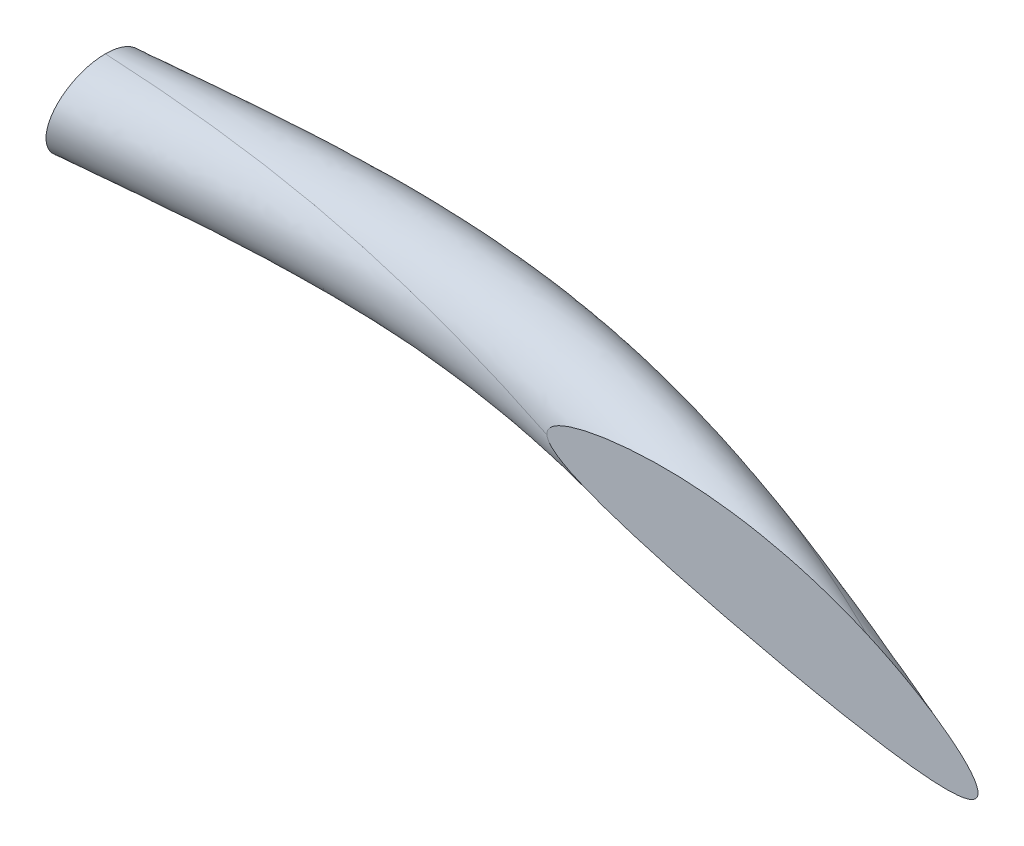
ISO-10303-21;
HEADER;
FILE_DESCRIPTION(('STEP AP214'),'2;1');
FILE_NAME('part.step','',(''),(''),'','','');
FILE_SCHEMA(('AUTOMOTIVE_DESIGN { 1 0 10303 214 1 1 1 1 }'));
ENDSEC;
DATA;
#1=APPLICATION_CONTEXT('core data for automotive mechanical design processes');
#2=APPLICATION_PROTOCOL_DEFINITION('international standard','automotive_design',2000,#1);
#3=PRODUCT_CONTEXT('',#1,'mechanical');
#4=PRODUCT('Part','Part','',(#3));
#5=PRODUCT_RELATED_PRODUCT_CATEGORY('part','',(#4));
#6=PRODUCT_DEFINITION_FORMATION('','',#4);
#7=PRODUCT_DEFINITION_CONTEXT('part definition',#1,'design');
#8=PRODUCT_DEFINITION('design','',#6,#7);
#9=PRODUCT_DEFINITION_SHAPE('','',#8);
#10=(LENGTH_UNIT() NAMED_UNIT(*) SI_UNIT(.MILLI.,.METRE.));
#11=(NAMED_UNIT(*) PLANE_ANGLE_UNIT() SI_UNIT($,.RADIAN.));
#12=(NAMED_UNIT(*) SI_UNIT($,.STERADIAN.) SOLID_ANGLE_UNIT());
#13=UNCERTAINTY_MEASURE_WITH_UNIT(LENGTH_MEASURE(1.E-05),#10,'distance_accuracy_value','');
#14=(GEOMETRIC_REPRESENTATION_CONTEXT(3) GLOBAL_UNCERTAINTY_ASSIGNED_CONTEXT((#13)) GLOBAL_UNIT_ASSIGNED_CONTEXT((#10,
#11,#12)) REPRESENTATION_CONTEXT('',''));
#15=CARTESIAN_POINT('',(0.,0.,0.));
#16=DIRECTION('',(0.,0.,1.));
#17=DIRECTION('',(1.,0.,0.));
#18=AXIS2_PLACEMENT_3D('',#15,#16,#17);
#19=CARTESIAN_POINT('',(0.,0.,0.));
#20=DIRECTION('',(0.,0.,1.));
#21=DIRECTION('',(1.,0.,0.));
#22=AXIS2_PLACEMENT_3D('',#19,#20,#21);
#23=PLANE('',#22);
#24=CARTESIAN_POINT('',(15.1545876871134,-4.28927799328883,0.));
#25=CARTESIAN_POINT('',(15.1181243170063,-4.27334871738877,0.));
#26=CARTESIAN_POINT('',(15.0812952441633,-4.2582644201544,0.));
#27=CARTESIAN_POINT('',(15.0069946485799,-4.22976043701186,0.));
#28=CARTESIAN_POINT('',(14.9695230746855,-4.21634088435277,0.));
#29=CARTESIAN_POINT('',(14.8939301368644,-4.19110948653116,0.));
#30=CARTESIAN_POINT('',(14.8558072887579,-4.17930209095788,0.));
#31=CARTESIAN_POINT('',(14.7790849554384,-4.15736616791501,0.));
#32=CARTESIAN_POINT('',(14.7404854964331,-4.14723754857129,0.));
#33=CARTESIAN_POINT('',(14.6290167928493,-4.12067047478006,0.));
#34=CARTESIAN_POINT('',(14.5556136687536,-4.10643112773538,0.));
#35=CARTESIAN_POINT('',(14.4080680671878,-4.08397624388415,0.));
#36=CARTESIAN_POINT('',(14.3339277174698,-4.07574671277815,0.));
#37=CARTESIAN_POINT('',(14.2225457996808,-4.0681470931353,0.));
#38=CARTESIAN_POINT('',(14.1854579790964,-4.06640354650086,0.));
#39=CARTESIAN_POINT('',(14.1297285732536,-4.06504649584388,0.));
#40=CARTESIAN_POINT('',(14.1111021107461,-4.06480456445942,0.));
#41=CARTESIAN_POINT('',(14.0738490300188,-4.06477678993557,0.));
#42=CARTESIAN_POINT('',(14.0552224118017,-4.06499095445912,0.));
#43=CARTESIAN_POINT('',(13.9989973955555,-4.06625167518482,0.));
#44=CARTESIAN_POINT('',(13.9614103507879,-4.06792410934439,0.));
#45=CARTESIAN_POINT('',(13.8863083473254,-4.07311330575888,0.));
#46=CARTESIAN_POINT('',(13.8487935761266,-4.07663277866245,0.));
#47=CARTESIAN_POINT('',(13.774271402616,-4.08587748446365,0.));
#48=CARTESIAN_POINT('',(13.7372622848487,-4.0915875841855,0.));
#49=CARTESIAN_POINT('',(13.6822662770898,-4.10253927336216,0.));
#50=CARTESIAN_POINT('',(13.6640409402991,-4.10658165831164,0.));
#51=CARTESIAN_POINT('',(13.6278619404032,-4.11572737106718,0.));
#52=CARTESIAN_POINT('',(13.6099080457382,-4.12082973262418,0.));
#53=CARTESIAN_POINT('',(13.5844856851215,-4.12930135993528,0.));
#54=CARTESIAN_POINT('',(13.5768042151664,-4.13202928906399,0.));
#55=CARTESIAN_POINT('',(13.5615722305509,-4.13787967926091,0.));
#56=CARTESIAN_POINT('',(13.5540220193831,-4.14100294414533,0.));
#57=CARTESIAN_POINT('',(13.5385195155854,-4.14804405188475,0.));
#58=CARTESIAN_POINT('',(13.5305873432079,-4.15200679213643,1.8377238870652E-13));
#59=CARTESIAN_POINT('',(13.5152176653499,-4.16078384722854,-1.83097207067371E-13));
#60=CARTESIAN_POINT('',(13.5077784495294,-4.16559497988475,-6.8736402754007E-13));
#61=CARTESIAN_POINT('',(13.4952171227837,-4.17549258963199,-5.74875282358534E-13));
#62=CARTESIAN_POINT('',(13.489922983129,-4.18035446096102,-1.5229396050939E-13));
#63=CARTESIAN_POINT('',(13.4806836918408,-4.19148170566382,1.53606247488127E-13));
#64=CARTESIAN_POINT('',(13.4767522851241,-4.19776038117712,0.));
#65=CARTESIAN_POINT('',(13.4729047779431,-4.20928244697291,0.));
#66=CARTESIAN_POINT('',(13.4720985446064,-4.21419825666302,0.));
#67=CARTESIAN_POINT('',(13.4721627753132,-4.22038044714986,0.));
#68=CARTESIAN_POINT('',(13.4722370143611,-4.22167786624889,0.));
#69=CARTESIAN_POINT('',(13.472374121944,-4.22296712247633,0.));
#70=B_SPLINE_CURVE_WITH_KNOTS('',3,(#24,#25,#26,#27,#28,#29,#30,#31,#32,#33,#34,#35,#36,#37,#38,
#39,#40,#41,#42,#43,#44,#45,#46,#47,#48,#49,#50,#51,#52,#53,#54,#55,#56,#57,#58,#59,#60,#61,#62,
#63,#64,#65,#66,#67,#68,#69),.UNSPECIFIED.,.F.,.F.,(4,2,2,2,2,2,2,2,2,2,2,2,2,2,2,2,2,2,2,2,2,2,
4),(0.,0.119357406752123,0.23872436092545,0.358414383804627,0.478097854261914,0.702141553349013,
0.9256618720119,1.03701507155676,1.09289379201093,1.14877345129999,1.26160167142086,
1.37459593919679,1.48682328660203,1.54281004897532,1.59874599737229,1.62319308642761,
1.64769070593966,1.67426357152597,1.70073880813184,1.72220129041977,1.74387434709188,
1.75849752181143,1.76239048272044),.UNSPECIFIED.);
#71=CARTESIAN_POINT('',(15.1545876871134,-4.28927799328883,0.));
#72=VERTEX_POINT('',#71);
#73=CARTESIAN_POINT('',(13.472374121944,-4.22296712247633,0.));
#74=VERTEX_POINT('',#73);
#75=EDGE_CURVE('E11',#72,#74,#70,.T.);
#76=ORIENTED_EDGE('',*,*,#75,.T.);
#77=CARTESIAN_POINT('',(13.472374121944,-4.22296712247633,0.));
#78=CARTESIAN_POINT('',(13.4726941596036,-4.22616155823125,0.));
#79=CARTESIAN_POINT('',(13.4733711508282,-4.22929105450249,0.));
#80=CARTESIAN_POINT('',(13.4752633786644,-4.23532722567702,0.));
#81=CARTESIAN_POINT('',(13.4764690009374,-4.23823683906789,0.));
#82=CARTESIAN_POINT('',(13.4820843471676,-4.24951875821943,0.));
#83=CARTESIAN_POINT('',(13.488052791459,-4.25707544547777,0.));
#84=CARTESIAN_POINT('',(13.4994505486749,-4.26896686353019,0.));
#85=CARTESIAN_POINT('',(13.5046033242716,-4.27362466285265,0.));
#86=CARTESIAN_POINT('',(13.5153250050976,-4.2824431787203,0.));
#87=CARTESIAN_POINT('',(13.5208934769822,-4.28660440147925,0.));
#88=CARTESIAN_POINT('',(13.5323043086526,-4.2945729351573,0.));
#89=CARTESIAN_POINT('',(13.5381477654923,-4.29837860873243,0.));
#90=CARTESIAN_POINT('',(13.5500082359285,-4.30570663045111,0.));
#91=CARTESIAN_POINT('',(13.5560252212572,-4.30922902439057,0.));
#92=CARTESIAN_POINT('',(13.5757383662182,-4.32029920319647,0.));
#93=CARTESIAN_POINT('',(13.5896802688035,-4.32740637105405,0.));
#94=CARTESIAN_POINT('',(13.6179005824677,-4.34092351399825,0.));
#95=CARTESIAN_POINT('',(13.6321792302612,-4.34733297971847,0.));
#96=CARTESIAN_POINT('',(13.6753768843799,-4.36585738227822,0.));
#97=CARTESIAN_POINT('',(13.7046070609665,-4.37724250304956,0.));
#98=CARTESIAN_POINT('',(13.7634836980823,-4.39891472186486,0.));
#99=CARTESIAN_POINT('',(13.7931304717652,-4.40920093772631,0.));
#100=CARTESIAN_POINT('',(13.8526329526563,-4.42901207597649,0.));
#101=CARTESIAN_POINT('',(13.8824883288,-4.43853799457885,0.));
#102=CARTESIAN_POINT('',(14.0034333308587,-4.47594856011203,0.));
#103=CARTESIAN_POINT('',(14.0951946732326,-4.50164194330327,0.));
#104=CARTESIAN_POINT('',(14.2794414891853,-4.55051487608991,0.));
#105=CARTESIAN_POINT('',(14.3719275091064,-4.57369228327952,2.88401553179689E-13));
#106=CARTESIAN_POINT('',(14.5571770497467,-4.61803853577824,-2.87799201953779E-13));
#107=CARTESIAN_POINT('',(14.6499395874404,-4.63921147503583,-1.07384588502129E-12));
#108=CARTESIAN_POINT('',(14.8358668385133,-4.67955840034171,1.07343169654796E-12));
#109=CARTESIAN_POINT('',(14.9290313829708,-4.69873315424777,4.00532149556793E-12));
#110=CARTESIAN_POINT('',(15.053997156159,-4.72240090281989,1.57538962189725E-12));
#111=CARTESIAN_POINT('',(15.0855501064252,-4.7282027476536,4.22106148181216E-13));
#112=CARTESIAN_POINT('',(15.1487400042799,-4.73935119409682,-4.22146146660728E-13));
#113=CARTESIAN_POINT('',(15.1803769595446,-4.74469775251571,-1.12976389530602E-13));
#114=CARTESIAN_POINT('',(15.2437546542119,-4.75485041834334,1.13034546920223E-13));
#115=CARTESIAN_POINT('',(15.2754954386563,-4.75965624612476,0.));
#116=CARTESIAN_POINT('',(15.3390783877935,-4.76853166566273,0.));
#117=CARTESIAN_POINT('',(15.3709205391121,-4.77260135075551,0.));
#118=CARTESIAN_POINT('',(15.4309217419722,-4.77920504210929,0.));
#119=CARTESIAN_POINT('',(15.4590666145692,-4.78186438778478,0.));
#120=CARTESIAN_POINT('',(15.5154267965558,-4.78581651651648,0.));
#121=CARTESIAN_POINT('',(15.543641956386,-4.78711116894369,0.));
#122=CARTESIAN_POINT('',(15.5908065177725,-4.7871163406721,0.));
#123=CARTESIAN_POINT('',(15.6097434933178,-4.78653817275815,0.));
#124=CARTESIAN_POINT('',(15.6378243266682,-4.78402474439515,0.));
#125=CARTESIAN_POINT('',(15.6470363715417,-4.78293214525303,0.));
#126=CARTESIAN_POINT('',(15.6653210802561,-4.77993674266482,0.));
#127=CARTESIAN_POINT('',(15.6743939346872,-4.77803517335985,0.));
#128=CARTESIAN_POINT('',(15.6922380643563,-4.77292630989152,0.));
#129=CARTESIAN_POINT('',(15.7010084863035,-4.76971560453962,0.));
#130=CARTESIAN_POINT('',(15.71539446508,-4.76193704343175,0.));
#131=CARTESIAN_POINT('',(15.7212567933303,-4.75789370819147,0.));
#132=CARTESIAN_POINT('',(15.7296805325067,-4.74918003772342,0.));
#133=CARTESIAN_POINT('',(15.7327064941739,-4.74499401818962,0.));
#134=CARTESIAN_POINT('',(15.737052105904,-4.73578403274836,0.));
#135=CARTESIAN_POINT('',(15.7383660723539,-4.73075733789521,1.4913528519066E-13));
#136=CARTESIAN_POINT('',(15.7394557475371,-4.71935122611031,1.77637775891137E-13));
#137=CARTESIAN_POINT('',(15.7387754324158,-4.71294226211483,0.));
#138=CARTESIAN_POINT('',(15.7361061167175,-4.7013720115497,0.));
#139=CARTESIAN_POINT('',(15.7343000795966,-4.69615722022901,0.));
#140=CARTESIAN_POINT('',(15.729987631816,-4.68601377229952,0.));
#141=CARTESIAN_POINT('',(15.7274790789012,-4.68108604748842,0.));
#142=CARTESIAN_POINT('',(15.7205306223097,-4.66889526330596,0.));
#143=CARTESIAN_POINT('',(15.7157807929718,-4.66181382673097,0.));
#144=CARTESIAN_POINT('',(15.7056683796355,-4.64812556032854,0.));
#145=CARTESIAN_POINT('',(15.7003060790298,-4.64151851328574,0.));
#146=CARTESIAN_POINT('',(15.6835565181969,-4.62215384058449,0.));
#147=CARTESIAN_POINT('',(15.6715577942469,-4.60992946117802,0.));
#148=CARTESIAN_POINT('',(15.6469019421103,-4.58659010875435,0.));
#149=CARTESIAN_POINT('',(15.6342575748672,-4.57546111077839,0.));
#150=CARTESIAN_POINT('',(15.6084038743425,-4.55386857953258,0.));
#151=CARTESIAN_POINT('',(15.5951942619734,-4.54340538149015,0.));
#152=CARTESIAN_POINT('',(15.5550541402107,-4.51287393264059,0.));
#153=CARTESIAN_POINT('',(15.5275295729459,-4.49358997307651,0.));
#154=CARTESIAN_POINT('',(15.472186778073,-4.45704573882289,0.));
#155=CARTESIAN_POINT('',(15.444393856247,-4.43974644891943,0.));
#156=CARTESIAN_POINT('',(15.3880550760593,-4.40639658914301,0.));
#157=CARTESIAN_POINT('',(15.3595089103912,-4.39034653981809,0.));
#158=CARTESIAN_POINT('',(15.3018915857084,-4.35941724264536,0.));
#159=CARTESIAN_POINT('',(15.2728220952518,-4.34453488228259,0.));
#160=CARTESIAN_POINT('',(15.2141246806215,-4.31598233174444,0.));
#161=CARTESIAN_POINT('',(15.1844972499671,-4.3023111261798,0.));
#162=CARTESIAN_POINT('',(15.1545876871137,-4.28927799328895,0.));
#163=B_SPLINE_CURVE_WITH_KNOTS('',3,(#77,#78,#79,#80,#81,#82,#83,#84,#85,#86,#87,#88,#89,#90,
#91,#92,#93,#94,#95,#96,#97,#98,#99,#100,#101,#102,#103,#104,#105,#106,#107,#108,#109,#110,#111,
#112,#113,#114,#115,#116,#117,#118,#119,#120,#121,#122,#123,#124,#125,#126,#127,#128,#129,#130,
#131,#132,#133,#134,#135,#136,#137,#138,#139,#140,#141,#142,#143,#144,#145,#146,#147,#148,#149,
#150,#151,#152,#153,#154,#155,#156,#157,#158,#159,#160,#161,#162),.UNSPECIFIED.,.F.,.F.,(4,2,2,
2,2,2,2,2,2,2,2,2,2,2,2,2,2,2,2,2,2,2,2,2,2,2,2,2,2,2,2,2,2,2,2,2,2,2,2,2,2,2,4),(0.,
0.00956971426466233,0.0189721677349024,0.0473344549588859,0.0681777846172069,0.0889996815619074,
0.109913171959075,0.1308232745887,0.177733058993047,0.224676863992038,0.3187343236816,
0.412866732543657,0.506873703066872,0.792654924052529,1.07867761571832,1.36410292461323,
1.64941814334102,1.74566160573581,1.84191418809289,1.9382163188464,2.03450623078811,
2.11929942476987,2.20397631661126,2.26073252044884,2.28853831897647,2.31630184905889,
2.34413818906657,2.36516131421089,2.38035813320476,2.39560527628294,2.41458992487279,
2.43108948986183,2.44763992707234,2.47315952286837,2.49866735813245,2.54995752642183,
2.60046903611442,2.65100578012168,2.7517475831066,2.84992524592638,2.94814360194004,
3.04609056981003,3.14395462958711),.UNSPECIFIED.);
#164=EDGE_CURVE('E87',#74,#72,#163,.T.);
#165=ORIENTED_EDGE('',*,*,#164,.T.);
#166=EDGE_LOOP('',(#76,#165));
#167=FACE_BOUND('',#166,.T.);
#168=ADVANCED_FACE('F46',(#167),#23,.T.);
#169=CARTESIAN_POINT('',(10.8853903658506,-3.91386347608221,-0.265165042944956));
#170=DIRECTION('',(-0.974370064785235,0.224951054343867,0.));
#171=DIRECTION('',(0.,0.,1.));
#172=AXIS2_PLACEMENT_3D('',#169,#170,#171);
#173=PLANE('',#172);
#174=CARTESIAN_POINT('',(10.8291526022646,-4.15745599227852,-0.265165042944958));
#175=DIRECTION('',(-0.974370064785235,0.224951054343864,0.));
#176=DIRECTION('',(0.224951054343864,0.974370064785236,0.));
#177=AXIS2_PLACEMENT_3D('',#174,#175,#176);
#178=CIRCLE('',#177,0.25);
#179=CARTESIAN_POINT('',(10.7729148386787,-4.40104850847483,-0.265165042944959));
#180=VERTEX_POINT('',#179);
#181=CARTESIAN_POINT('',(10.8853903658506,-3.91386347608221,-0.265165042944956));
#182=VERTEX_POINT('',#181);
#183=EDGE_CURVE('E85',#180,#182,#178,.T.);
#184=ORIENTED_EDGE('',*,*,#183,.T.);
#185=CARTESIAN_POINT('',(10.8291526022646,-4.15745599227852,-0.265165042944958));
#186=DIRECTION('',(-0.974370064785235,0.224951054343864,0.));
#187=DIRECTION('',(0.224951054343864,0.974370064785236,0.));
#188=AXIS2_PLACEMENT_3D('',#185,#186,#187);
#189=CIRCLE('',#188,0.25);
#190=EDGE_CURVE('E84',#182,#180,#189,.T.);
#191=ORIENTED_EDGE('',*,*,#190,.T.);
#192=EDGE_LOOP('',(#184,#191));
#193=FACE_BOUND('',#192,.T.);
#194=ADVANCED_FACE('F93',(#193),#173,.T.);
#195=CARTESIAN_POINT('',(20.516615486531,-6.65055905191349,-0.265165042944959));
#196=CARTESIAN_POINT('',(20.2002598864563,-6.63165461302359,-0.162692344661536));
#197=CARTESIAN_POINT('',(19.8936288187836,-6.57062859664594,-0.0478354290456411));
#198=CARTESIAN_POINT('',(19.5869977511109,-6.5096025802683,0.0670214865702537));
#199=CARTESIAN_POINT('',(19.2904170757517,-6.40504353205746,0.176776695296632));
#200=CARTESIAN_POINT('',(18.9938364003925,-6.30048448384663,0.286531904023011));
#201=CARTESIAN_POINT('',(18.7061018961358,-6.15760845892587,0.374476170264727));
#202=CARTESIAN_POINT('',(18.418367391879,-6.01473243400512,0.462420436506442));
#203=CARTESIAN_POINT('',(18.1369280881539,-5.84458889985752,0.515165042944953));
#204=CARTESIAN_POINT('',(17.8554887844288,-5.67444536570993,0.567909649383464));
#205=CARTESIAN_POINT('',(17.5768353234499,-5.49223502091778,0.577424707819554));
#206=CARTESIAN_POINT('',(17.298181862471,-5.31002467612562,0.586939766255644));
#207=CARTESIAN_POINT('',(17.0183807671484,-5.13278528180593,0.551776695296638));
#208=CARTESIAN_POINT('',(16.7385796718257,-4.95554588748623,0.516613624337633));
#209=CARTESIAN_POINT('',(16.4538721819949,-4.79955842260835,0.442125682783008));
#210=CARTESIAN_POINT('',(16.1691646921641,-4.64357095773046,0.367637741228384));
#211=CARTESIAN_POINT('',(15.876539001748,-4.52188098765543,0.265165042944959));
#212=CARTESIAN_POINT('',(15.5839133113319,-4.40019101758041,0.162692344661536));
#213=CARTESIAN_POINT('',(15.2815630885138,-4.32062262499314,0.0478354290456411));
#214=CARTESIAN_POINT('',(14.9792128656958,-4.24105423240588,-0.0670214865702536));
#215=CARTESIAN_POINT('',(14.6668122505642,-4.20501887165179,-0.176776695296632));
#216=CARTESIAN_POINT('',(14.3544116354327,-4.16898351089772,-0.286531904023011));
#217=CARTESIAN_POINT('',(14.0331648491986,-4.17126512685355,-0.374476170264727));
#218=CARTESIAN_POINT('',(13.7119180629646,-4.1735467428094,-0.462420436506442));
#219=CARTESIAN_POINT('',(13.3843760761989,-4.20309586799207,-0.515165042944953));
#220=CARTESIAN_POINT('',(13.0568340894332,-4.23264499317476,-0.567909649383464));
#221=CARTESIAN_POINT('',(12.7265062599214,-4.27426092900198,-0.577424707819554));
#222=CARTESIAN_POINT('',(12.3961784304095,-4.31587686482922,-0.586939766255644));
#223=CARTESIAN_POINT('',(12.0669982352414,-4.352521850184,-0.551776695296638));
#224=CARTESIAN_POINT('',(11.7378180400733,-4.38916683553879,-0.516613624337633));
#225=CARTESIAN_POINT('',(11.4135442394133,-4.40455989145175,-0.442125682783009));
#226=CARTESIAN_POINT('',(11.0892704387534,-4.41995294736473,-0.367637741228384));
#227=CARTESIAN_POINT('',(10.7729148386787,-4.40104850847483,-0.265165042944959));
#228=CARTESIAN_POINT('',(20.516615486531,-6.65055905191348,-0.765165042944959));
#229=CARTESIAN_POINT('',(20.1778871130743,-6.72856174116874,-0.662692344661536));
#230=CARTESIAN_POINT('',(19.8505862979884,-6.75706623703883,-0.509775195301285));
#231=CARTESIAN_POINT('',(19.5232854829025,-6.78557073290894,-0.356858045941035));
#232=CARTESIAN_POINT('',(19.2108848677709,-6.74953537215486,-0.176776695296644));
#233=CARTESIAN_POINT('',(18.8984842526393,-6.71350001140078,0.00330465534774707));
#234=CARTESIAN_POINT('',(18.6021880586732,-6.60770873889925,0.183134454082178));
#235=CARTESIAN_POINT('',(18.305891864707,-6.50191746639773,0.36296425281661));
#236=CARTESIAN_POINT('',(18.024452560982,-6.33177393225013,0.51516504294495));
#237=CARTESIAN_POINT('',(17.7430132572569,-6.16163039810255,0.667365833073289));
#238=CARTESIAN_POINT('',(17.4729214859874,-5.94233530089117,0.768766424002094));
#239=CARTESIAN_POINT('',(17.2028297147178,-5.72304020367978,0.870167014930902));
#240=CARTESIAN_POINT('',(16.9388485591675,-5.47727712190333,0.905330085889909));
#241=CARTESIAN_POINT('',(16.6748674036173,-5.23151404012689,0.940493156848917));
#242=CARTESIAN_POINT('',(16.4108296611997,-4.98599606300125,0.904065449038649));
#243=CARTESIAN_POINT('',(16.146791918782,-4.74047808587561,0.867637741228382));
#244=CARTESIAN_POINT('',(15.876539001748,-4.52188098765543,0.765165042944959));
#245=CARTESIAN_POINT('',(15.6062860847139,-4.30328388943526,0.662692344661536));
#246=CARTESIAN_POINT('',(15.3246056093091,-4.13418498460024,0.509775195301285));
#247=CARTESIAN_POINT('',(15.0429251339042,-3.96508607976522,0.356858045941035));
#248=CARTESIAN_POINT('',(14.746344458545,-3.86052703155438,0.176776695296644));
#249=CARTESIAN_POINT('',(14.4497637831858,-3.75596798334355,-0.00330465534774718));
#250=CARTESIAN_POINT('',(14.1370786866612,-3.72116484688016,-0.183134454082178));
#251=CARTESIAN_POINT('',(13.8243935901366,-3.68636171041677,-0.362964252816609));
#252=CARTESIAN_POINT('',(13.4968516033709,-3.71591083559946,-0.51516504294495));
#253=CARTESIAN_POINT('',(13.1693096166051,-3.74545996078213,-0.667365833073289));
#254=CARTESIAN_POINT('',(12.8304200973839,-3.8241606490286,-0.768766424002094));
#255=CARTESIAN_POINT('',(12.4915305781627,-3.90286133727506,-0.870167014930902));
#256=CARTESIAN_POINT('',(12.1465304432222,-4.00803001008659,-0.905330085889909));
#257=CARTESIAN_POINT('',(11.8015303082817,-4.11319868289812,-0.940493156848917));
#258=CARTESIAN_POINT('',(11.4565867602085,-4.21812225105885,-0.904065449038649));
#259=CARTESIAN_POINT('',(11.1116432121354,-4.32304581921957,-0.867637741228382));
#260=CARTESIAN_POINT('',(10.7729148386787,-4.40104850847483,-0.765165042944959));
#261=CARTESIAN_POINT('',(20.6290910137029,-6.16337401952086,-0.765165042944956));
#262=CARTESIAN_POINT('',(20.2903626402462,-6.24137670877612,-0.762148528351361));
#263=CARTESIAN_POINT('',(19.9545001354509,-6.30696595706545,-0.701116911483828));
#264=CARTESIAN_POINT('',(19.6186376306557,-6.37255520535479,-0.640085294616293));
#265=CARTESIAN_POINT('',(19.2904170757517,-6.40504353205746,-0.530330085889915));
#266=CARTESIAN_POINT('',(18.9621965208477,-6.43753185876012,-0.420574877163537));
#267=CARTESIAN_POINT('',(18.6452305794684,-6.42127109850636,-0.278805312173463));
#268=CARTESIAN_POINT('',(18.3282646380891,-6.40501033825258,-0.137035747183389));
#269=CARTESIAN_POINT('',(18.024452560982,-6.33177393225013,0.0151650429449499));
#270=CARTESIAN_POINT('',(17.7206404838748,-6.25853752624769,0.167365833073289));
#271=CARTESIAN_POINT('',(17.4298789651921,-6.12877294128406,0.30682665774645));
#272=CARTESIAN_POINT('',(17.1391174465094,-5.99900835632044,0.446287482419612));
#273=CARTESIAN_POINT('',(16.8593163511867,-5.82176896200075,0.551776695296634));
#274=CARTESIAN_POINT('',(16.5795152558641,-5.64452956768104,0.657265908173653));
#275=CARTESIAN_POINT('',(16.3069158237371,-5.43609634297464,0.712723732856101));
#276=CARTESIAN_POINT('',(16.0343163916101,-5.22766311826823,0.768181557538549));
#277=CARTESIAN_POINT('',(15.764063474576,-5.00906602004805,0.765165042944956));
#278=CARTESIAN_POINT('',(15.493810557542,-4.79046892182788,0.762148528351361));
#279=CARTESIAN_POINT('',(15.2206917718465,-4.58428526457363,0.701116911483828));
#280=CARTESIAN_POINT('',(14.947572986151,-4.37810160731938,0.640085294616293));
#281=CARTESIAN_POINT('',(14.6668122505642,-4.2050188716518,0.530330085889915));
#282=CARTESIAN_POINT('',(14.3860515149774,-4.03193613598421,0.420574877163537));
#283=CARTESIAN_POINT('',(14.094036165866,-3.90760248727307,0.278805312173463));
#284=CARTESIAN_POINT('',(13.8020208167545,-3.78326883856193,0.137035747183389));
#285=CARTESIAN_POINT('',(13.4968516033709,-3.71591083559946,-0.0151650429449498));
#286=CARTESIAN_POINT('',(13.1916823899872,-3.64855283263698,-0.167365833073289));
#287=CARTESIAN_POINT('',(12.8734626181792,-3.6377230086357,-0.306826657746451));
#288=CARTESIAN_POINT('',(12.5552428463711,-3.6268931846344,-0.446287482419612));
#289=CARTESIAN_POINT('',(12.226062651203,-3.66353816998919,-0.551776695296634));
#290=CARTESIAN_POINT('',(11.8968824560349,-3.70018315534397,-0.657265908173653));
#291=CARTESIAN_POINT('',(11.5605005976711,-3.76802197108546,-0.712723732856101));
#292=CARTESIAN_POINT('',(11.2241187393073,-3.83586078682696,-0.768181557538549));
#293=CARTESIAN_POINT('',(10.8853903658506,-3.91386347608221,-0.765165042944956));
#294=CARTESIAN_POINT('',(20.629091013703,-6.16337401952087,-0.265165042944956));
#295=CARTESIAN_POINT('',(20.3127354136283,-6.14446958063098,-0.262148528351361));
#296=CARTESIAN_POINT('',(19.9975426562461,-6.12052831667255,-0.239177145228182));
#297=CARTESIAN_POINT('',(19.6823498988641,-6.09658705271414,-0.216205762105004));
#298=CARTESIAN_POINT('',(19.3699492837325,-6.06055169196005,-0.176776695296639));
#299=CARTESIAN_POINT('',(19.0575486686009,-6.02451633120597,-0.137347628488274));
#300=CARTESIAN_POINT('',(18.7491444169309,-5.97117081853297,-0.0874635959909151));
#301=CARTESIAN_POINT('',(18.440740165261,-5.91782530585997,-0.0375795634935566));
#302=CARTESIAN_POINT('',(18.1369280881539,-5.84458889985752,0.0151650429449534));
#303=CARTESIAN_POINT('',(17.8331160110468,-5.77135249385508,0.0679096493834633));
#304=CARTESIAN_POINT('',(17.5337928026547,-5.67867266131068,0.115484941563909));
#305=CARTESIAN_POINT('',(17.2344695942626,-5.58599282876628,0.163060233744356));
#306=CARTESIAN_POINT('',(16.9388485591675,-5.47727712190333,0.198223304703362));
#307=CARTESIAN_POINT('',(16.6432275240725,-5.36856141504039,0.233386375662369));
#308=CARTESIAN_POINT('',(16.3499583445323,-5.24965870258173,0.25078396660046));
#309=CARTESIAN_POINT('',(16.0566891649922,-5.13075599012307,0.268181557538551));
#310=CARTESIAN_POINT('',(15.764063474576,-5.00906602004805,0.265165042944956));
#311=CARTESIAN_POINT('',(15.47143778416,-4.88737604997303,0.262148528351361));
#312=CARTESIAN_POINT('',(15.1776492510513,-4.77072290496654,0.239177145228182));
#313=CARTESIAN_POINT('',(14.8838607179426,-4.65406975996004,0.216205762105004));
#314=CARTESIAN_POINT('',(14.5872800425834,-4.5495107117492,0.176776695296639));
#315=CARTESIAN_POINT('',(14.2906993672242,-4.44495166353838,0.137347628488274));
#316=CARTESIAN_POINT('',(13.9901223284034,-4.35770276724646,0.0874635959909153));
#317=CARTESIAN_POINT('',(13.6895452895826,-4.27045387095455,0.0375795634935567));
#318=CARTESIAN_POINT('',(13.3843760761989,-4.20309586799207,-0.0151650429449534));
#319=CARTESIAN_POINT('',(13.0792068628153,-4.1357378650296,-0.0679096493834633));
#320=CARTESIAN_POINT('',(12.7695487807166,-4.08782328860908,-0.115484941563909));
#321=CARTESIAN_POINT('',(12.4598906986179,-4.03990871218857,-0.163060233744356));
#322=CARTESIAN_POINT('',(12.1465304432222,-4.00803001008659,-0.198223304703362));
#323=CARTESIAN_POINT('',(11.8331701878265,-3.97615130798462,-0.233386375662369));
#324=CARTESIAN_POINT('',(11.5174580768759,-3.95445961147836,-0.25078396660046));
#325=CARTESIAN_POINT('',(11.2017459659253,-3.93276791497211,-0.268181557538551));
#326=CARTESIAN_POINT('',(10.8853903658506,-3.91386347608221,-0.265165042944956));
#327=(BOUNDED_SURFACE() B_SPLINE_SURFACE(3,2,((#195,#196,#197,#198,#199,#200,#201,#202,#203,
#204,#205,#206,#207,#208,#209,#210,#211,#212,#213,#214,#215,#216,#217,#218,#219,#220,#221,#222,
#223,#224,#225,#226,#227),(#228,#229,#230,#231,#232,#233,#234,#235,#236,#237,#238,#239,#240,
#241,#242,#243,#244,#245,#246,#247,#248,#249,#250,#251,#252,#253,#254,#255,#256,#257,#258,#259,
#260),(#261,#262,#263,#264,#265,#266,#267,#268,#269,#270,#271,#272,#273,#274,#275,#276,#277,
#278,#279,#280,#281,#282,#283,#284,#285,#286,#287,#288,#289,#290,#291,#292,#293),(#294,#295,
#296,#297,#298,#299,#300,#301,#302,#303,#304,#305,#306,#307,#308,#309,#310,#311,#312,#313,#314,
#315,#316,#317,#318,#319,#320,#321,#322,#323,#324,#325,#326)),.UNSPECIFIED.,.F.,.F.,
.F.) B_SPLINE_SURFACE_WITH_KNOTS((4,4),(3,2,2,2,2,2,2,2,2,2,2,2,2,2,2,2,3),(0.,0.5),(0.,0.0625,
0.125,0.1875,0.25,0.3125,0.375,0.4375,0.5,0.5625,0.625,0.6875,0.75,0.8125,0.875,0.9375,1.),
.UNSPECIFIED.) GEOMETRIC_REPRESENTATION_ITEM() RATIONAL_B_SPLINE_SURFACE(((1.,0.98078528040323,
1.,0.98078528040323,1.,0.98078528040323,1.,0.98078528040323,1.,0.98078528040323,1.,
0.98078528040323,1.,0.98078528040323,1.,0.98078528040323,1.,0.98078528040323,1.,
0.98078528040323,1.,0.98078528040323,1.,0.98078528040323,1.,0.98078528040323,1.,
0.98078528040323,1.,0.98078528040323,1.,0.98078528040323,1.),(0.333333333333334,
0.326928426801077,0.333333333333334,0.326928426801077,0.333333333333334,0.326928426801077,
0.333333333333334,0.326928426801077,0.333333333333334,0.326928426801077,0.333333333333334,
0.326928426801077,0.333333333333334,0.326928426801077,0.333333333333334,0.326928426801077,
0.333333333333334,0.326928426801077,0.333333333333334,0.326928426801077,0.333333333333334,
0.326928426801077,0.333333333333334,0.326928426801077,0.333333333333334,0.326928426801077,
0.333333333333334,0.326928426801077,0.333333333333334,0.326928426801077,0.333333333333334,
0.326928426801077,0.333333333333334),(0.333333333333334,0.326928426801077,0.333333333333334,
0.326928426801077,0.333333333333334,0.326928426801077,0.333333333333334,0.326928426801077,
0.333333333333334,0.326928426801077,0.333333333333334,0.326928426801077,0.333333333333334,
0.326928426801077,0.333333333333334,0.326928426801077,0.333333333333334,0.326928426801077,
0.333333333333334,0.326928426801077,0.333333333333334,0.326928426801077,0.333333333333334,
0.326928426801077,0.333333333333334,0.326928426801077,0.333333333333334,0.326928426801077,
0.333333333333334,0.326928426801077,0.333333333333334,0.326928426801077,0.333333333333334),(1.,
0.98078528040323,1.,0.98078528040323,1.,0.98078528040323,1.,0.98078528040323,1.,
0.98078528040323,1.,0.98078528040323,1.,0.98078528040323,1.,0.98078528040323,1.,
0.98078528040323,1.,0.98078528040323,1.,0.98078528040323,1.,0.98078528040323,1.,
0.98078528040323,1.,0.98078528040323,1.,0.98078528040323,1.,0.98078528040323,1.))) REPRESENTATION_ITEM('') SURFACE());
#328=CARTESIAN_POINT('',(20.516615486531,-6.65055905191349,-0.265165042944959));
#329=CARTESIAN_POINT('',(20.2002598864563,-6.63165461302359,-0.162692344661536));
#330=CARTESIAN_POINT('',(19.8936288187836,-6.57062859664594,-0.0478354290456411));
#331=CARTESIAN_POINT('',(19.5869977511109,-6.5096025802683,0.0670214865702537));
#332=CARTESIAN_POINT('',(19.2904170757517,-6.40504353205746,0.176776695296632));
#333=CARTESIAN_POINT('',(18.9938364003925,-6.30048448384663,0.286531904023011));
#334=CARTESIAN_POINT('',(18.7061018961358,-6.15760845892587,0.374476170264727));
#335=CARTESIAN_POINT('',(18.418367391879,-6.01473243400512,0.462420436506442));
#336=CARTESIAN_POINT('',(18.1369280881539,-5.84458889985752,0.515165042944953));
#337=CARTESIAN_POINT('',(17.8554887844288,-5.67444536570993,0.567909649383464));
#338=CARTESIAN_POINT('',(17.5768353234499,-5.49223502091778,0.577424707819554));
#339=CARTESIAN_POINT('',(17.298181862471,-5.31002467612562,0.586939766255644));
#340=CARTESIAN_POINT('',(17.0183807671484,-5.13278528180593,0.551776695296638));
#341=CARTESIAN_POINT('',(16.7385796718257,-4.95554588748623,0.516613624337633));
#342=CARTESIAN_POINT('',(16.4538721819949,-4.79955842260835,0.442125682783008));
#343=CARTESIAN_POINT('',(16.1691646921641,-4.64357095773046,0.367637741228384));
#344=CARTESIAN_POINT('',(15.876539001748,-4.52188098765543,0.265165042944959));
#345=CARTESIAN_POINT('',(15.5839133113319,-4.40019101758041,0.162692344661536));
#346=CARTESIAN_POINT('',(15.2815630885138,-4.32062262499314,0.0478354290456411));
#347=CARTESIAN_POINT('',(14.9792128656958,-4.24105423240588,-0.0670214865702536));
#348=CARTESIAN_POINT('',(14.6668122505642,-4.20501887165179,-0.176776695296632));
#349=CARTESIAN_POINT('',(14.3544116354327,-4.16898351089772,-0.286531904023011));
#350=CARTESIAN_POINT('',(14.0331648491986,-4.17126512685355,-0.374476170264727));
#351=CARTESIAN_POINT('',(13.7119180629646,-4.1735467428094,-0.462420436506442));
#352=CARTESIAN_POINT('',(13.3843760761989,-4.20309586799207,-0.515165042944953));
#353=CARTESIAN_POINT('',(13.0568340894332,-4.23264499317476,-0.567909649383464));
#354=CARTESIAN_POINT('',(12.7265062599214,-4.27426092900198,-0.577424707819554));
#355=CARTESIAN_POINT('',(12.3961784304095,-4.31587686482922,-0.586939766255644));
#356=CARTESIAN_POINT('',(12.0669982352414,-4.352521850184,-0.551776695296638));
#357=CARTESIAN_POINT('',(11.7378180400733,-4.38916683553879,-0.516613624337633));
#358=CARTESIAN_POINT('',(11.4135442394133,-4.40455989145175,-0.442125682783009));
#359=CARTESIAN_POINT('',(11.0892704387534,-4.41995294736473,-0.367637741228384));
#360=CARTESIAN_POINT('',(10.7729148386787,-4.40104850847483,-0.265165042944959));
#361=(BOUNDED_CURVE() B_SPLINE_CURVE(2,(#328,#329,#330,#331,#332,#333,#334,#335,#336,#337,#338,
#339,#340,#341,#342,#343,#344,#345,#346,#347,#348,#349,#350,#351,#352,#353,#354,#355,#356,#357,
#358,#359,#360),.UNSPECIFIED.,.F.,.F.) B_SPLINE_CURVE_WITH_KNOTS((3,2,2,2,2,2,2,2,2,2,2,2,2,2,2,
2,3),(0.,0.0625,0.125,0.1875,0.25,0.3125,0.375,0.4375,0.5,0.5625,0.625,0.6875,0.75,0.8125,0.875,
0.9375,1.),.UNSPECIFIED.) CURVE() GEOMETRIC_REPRESENTATION_ITEM() RATIONAL_B_SPLINE_CURVE((1.,
0.98078528040323,1.,0.98078528040323,1.,0.98078528040323,1.,0.98078528040323,1.,
0.98078528040323,1.,0.98078528040323,1.,0.98078528040323,1.,0.98078528040323,1.,
0.98078528040323,1.,0.98078528040323,1.,0.98078528040323,1.,0.98078528040323,1.,
0.98078528040323,1.,0.98078528040323,1.,0.98078528040323,1.,0.98078528040323,1.)) REPRESENTATION_ITEM(''));
#362=EDGE_CURVE('E89',#72,#180,#361,.T.);
#363=CARTESIAN_POINT('',(20.629091013703,-6.16337401952087,-0.265165042944956));
#364=CARTESIAN_POINT('',(20.3127354136283,-6.14446958063098,-0.262148528351361));
#365=CARTESIAN_POINT('',(19.9975426562461,-6.12052831667255,-0.239177145228182));
#366=CARTESIAN_POINT('',(19.6823498988641,-6.09658705271414,-0.216205762105004));
#367=CARTESIAN_POINT('',(19.3699492837325,-6.06055169196005,-0.176776695296639));
#368=CARTESIAN_POINT('',(19.0575486686009,-6.02451633120597,-0.137347628488274));
#369=CARTESIAN_POINT('',(18.7491444169309,-5.97117081853297,-0.0874635959909151));
#370=CARTESIAN_POINT('',(18.440740165261,-5.91782530585997,-0.0375795634935566));
#371=CARTESIAN_POINT('',(18.1369280881539,-5.84458889985752,0.0151650429449534));
#372=CARTESIAN_POINT('',(17.8331160110468,-5.77135249385508,0.0679096493834633));
#373=CARTESIAN_POINT('',(17.5337928026547,-5.67867266131068,0.115484941563909));
#374=CARTESIAN_POINT('',(17.2344695942626,-5.58599282876628,0.163060233744356));
#375=CARTESIAN_POINT('',(16.9388485591675,-5.47727712190333,0.198223304703362));
#376=CARTESIAN_POINT('',(16.6432275240725,-5.36856141504039,0.233386375662369));
#377=CARTESIAN_POINT('',(16.3499583445323,-5.24965870258173,0.25078396660046));
#378=CARTESIAN_POINT('',(16.0566891649922,-5.13075599012307,0.268181557538551));
#379=CARTESIAN_POINT('',(15.764063474576,-5.00906602004805,0.265165042944956));
#380=CARTESIAN_POINT('',(15.47143778416,-4.88737604997303,0.262148528351361));
#381=CARTESIAN_POINT('',(15.1776492510513,-4.77072290496654,0.239177145228182));
#382=CARTESIAN_POINT('',(14.8838607179426,-4.65406975996004,0.216205762105004));
#383=CARTESIAN_POINT('',(14.5872800425834,-4.5495107117492,0.176776695296639));
#384=CARTESIAN_POINT('',(14.2906993672242,-4.44495166353838,0.137347628488274));
#385=CARTESIAN_POINT('',(13.9901223284034,-4.35770276724646,0.0874635959909153));
#386=CARTESIAN_POINT('',(13.6895452895826,-4.27045387095455,0.0375795634935567));
#387=CARTESIAN_POINT('',(13.3843760761989,-4.20309586799207,-0.0151650429449534));
#388=CARTESIAN_POINT('',(13.0792068628153,-4.1357378650296,-0.0679096493834633));
#389=CARTESIAN_POINT('',(12.7695487807166,-4.08782328860908,-0.115484941563909));
#390=CARTESIAN_POINT('',(12.4598906986179,-4.03990871218857,-0.163060233744356));
#391=CARTESIAN_POINT('',(12.1465304432222,-4.00803001008659,-0.198223304703362));
#392=CARTESIAN_POINT('',(11.8331701878265,-3.97615130798462,-0.233386375662369));
#393=CARTESIAN_POINT('',(11.5174580768759,-3.95445961147836,-0.25078396660046));
#394=CARTESIAN_POINT('',(11.2017459659253,-3.93276791497211,-0.268181557538551));
#395=CARTESIAN_POINT('',(10.8853903658506,-3.91386347608221,-0.265165042944956));
#396=(BOUNDED_CURVE() B_SPLINE_CURVE(2,(#363,#364,#365,#366,#367,#368,#369,#370,#371,#372,#373,
#374,#375,#376,#377,#378,#379,#380,#381,#382,#383,#384,#385,#386,#387,#388,#389,#390,#391,#392,
#393,#394,#395),.UNSPECIFIED.,.F.,.F.) B_SPLINE_CURVE_WITH_KNOTS((3,2,2,2,2,2,2,2,2,2,2,2,2,2,2,
2,3),(0.,0.0625,0.125,0.1875,0.25,0.3125,0.375,0.4375,0.5,0.5625,0.625,0.6875,0.75,0.8125,0.875,
0.9375,1.),.UNSPECIFIED.) CURVE() GEOMETRIC_REPRESENTATION_ITEM() RATIONAL_B_SPLINE_CURVE((1.,
0.98078528040323,1.,0.98078528040323,1.,0.98078528040323,1.,0.98078528040323,1.,
0.98078528040323,1.,0.98078528040323,1.,0.98078528040323,1.,0.98078528040323,1.,
0.98078528040323,1.,0.98078528040323,1.,0.98078528040323,1.,0.98078528040323,1.,
0.98078528040323,1.,0.98078528040323,1.,0.98078528040323,1.,0.98078528040323,1.)) REPRESENTATION_ITEM(''));
#397=EDGE_CURVE('E62',#74,#182,#396,.T.);
#398=ORIENTED_EDGE('',*,*,#75,.F.);
#399=ORIENTED_EDGE('',*,*,#362,.T.);
#400=ORIENTED_EDGE('',*,*,#190,.F.);
#401=ORIENTED_EDGE('',*,*,#397,.F.);
#402=EDGE_LOOP('',(#398,#399,#400,#401));
#403=FACE_BOUND('',#402,.T.);
#404=ADVANCED_FACE('F48',(#403),#327,.F.);
#405=CARTESIAN_POINT('',(20.629091013703,-6.16337401952087,-0.265165042944956));
#406=CARTESIAN_POINT('',(20.3127354136283,-6.14446958063098,-0.262148528351361));
#407=CARTESIAN_POINT('',(19.9975426562461,-6.12052831667255,-0.239177145228182));
#408=CARTESIAN_POINT('',(19.6823498988641,-6.09658705271414,-0.216205762105004));
#409=CARTESIAN_POINT('',(19.3699492837325,-6.06055169196005,-0.176776695296639));
#410=CARTESIAN_POINT('',(19.0575486686009,-6.02451633120597,-0.137347628488274));
#411=CARTESIAN_POINT('',(18.7491444169309,-5.97117081853297,-0.0874635959909151));
#412=CARTESIAN_POINT('',(18.440740165261,-5.91782530585997,-0.0375795634935566));
#413=CARTESIAN_POINT('',(18.1369280881539,-5.84458889985752,0.0151650429449534));
#414=CARTESIAN_POINT('',(17.8331160110468,-5.77135249385508,0.0679096493834633));
#415=CARTESIAN_POINT('',(17.5337928026547,-5.67867266131068,0.115484941563909));
#416=CARTESIAN_POINT('',(17.2344695942626,-5.58599282876628,0.163060233744356));
#417=CARTESIAN_POINT('',(16.9388485591675,-5.47727712190333,0.198223304703362));
#418=CARTESIAN_POINT('',(16.6432275240725,-5.36856141504039,0.233386375662369));
#419=CARTESIAN_POINT('',(16.3499583445323,-5.24965870258173,0.25078396660046));
#420=CARTESIAN_POINT('',(16.0566891649922,-5.13075599012307,0.268181557538551));
#421=CARTESIAN_POINT('',(15.764063474576,-5.00906602004805,0.265165042944956));
#422=CARTESIAN_POINT('',(15.47143778416,-4.88737604997303,0.262148528351361));
#423=CARTESIAN_POINT('',(15.1776492510513,-4.77072290496654,0.239177145228182));
#424=CARTESIAN_POINT('',(14.8838607179426,-4.65406975996004,0.216205762105004));
#425=CARTESIAN_POINT('',(14.5872800425834,-4.5495107117492,0.176776695296639));
#426=CARTESIAN_POINT('',(14.2906993672242,-4.44495166353838,0.137347628488274));
#427=CARTESIAN_POINT('',(13.9901223284034,-4.35770276724646,0.0874635959909153));
#428=CARTESIAN_POINT('',(13.6895452895826,-4.27045387095455,0.0375795634935567));
#429=CARTESIAN_POINT('',(13.3843760761989,-4.20309586799207,-0.0151650429449534));
#430=CARTESIAN_POINT('',(13.0792068628153,-4.1357378650296,-0.0679096493834633));
#431=CARTESIAN_POINT('',(12.7695487807166,-4.08782328860908,-0.115484941563909));
#432=CARTESIAN_POINT('',(12.4598906986179,-4.03990871218857,-0.163060233744356));
#433=CARTESIAN_POINT('',(12.1465304432222,-4.00803001008659,-0.198223304703362));
#434=CARTESIAN_POINT('',(11.8331701878265,-3.97615130798462,-0.233386375662369));
#435=CARTESIAN_POINT('',(11.5174580768759,-3.95445961147836,-0.25078396660046));
#436=CARTESIAN_POINT('',(11.2017459659253,-3.93276791497211,-0.268181557538551));
#437=CARTESIAN_POINT('',(10.8853903658506,-3.91386347608221,-0.265165042944956));
#438=CARTESIAN_POINT('',(20.6290910137029,-6.16337401952086,0.234834957055044));
#439=CARTESIAN_POINT('',(20.3351081870103,-6.04756245248583,0.237851471648639));
#440=CARTESIAN_POINT('',(20.0405851770414,-5.93409067627965,0.222762621027462));
#441=CARTESIAN_POINT('',(19.7460621670725,-5.82061890007347,0.207673770406285));
#442=CARTESIAN_POINT('',(19.4494814917133,-5.71605985186264,0.176776695296637));
#443=CARTESIAN_POINT('',(19.1529008163541,-5.61150080365181,0.14587962018699));
#444=CARTESIAN_POINT('',(18.8530582543935,-5.52107053855957,0.103878120191633));
#445=CARTESIAN_POINT('',(18.5532156924329,-5.43064027346735,0.061876620196276));
#446=CARTESIAN_POINT('',(18.2494036153258,-5.35740386746489,0.0151650429449569));
#447=CARTESIAN_POINT('',(17.9455915382187,-5.28416746146245,-0.0315465343063621));
#448=CARTESIAN_POINT('',(17.6377066401172,-5.22857238133728,-0.0758567746186321));
#449=CARTESIAN_POINT('',(17.3298217420158,-5.17297730121212,-0.120167014930902));
#450=CARTESIAN_POINT('',(17.0183807671483,-5.13278528180592,-0.155330085889909));
#451=CARTESIAN_POINT('',(16.7069397922809,-5.09259326239972,-0.190493156848915));
#452=CARTESIAN_POINT('',(16.3930008653275,-5.06322106218882,-0.211155799655182));
#453=CARTESIAN_POINT('',(16.0790619383742,-5.03384886197791,-0.231818442461448));
#454=CARTESIAN_POINT('',(15.764063474576,-5.00906602004805,-0.234834957055044));
#455=CARTESIAN_POINT('',(15.4490650107779,-4.98428317811817,-0.237851471648639));
#456=CARTESIAN_POINT('',(15.134606730256,-4.95716054535943,-0.222762621027462));
#457=CARTESIAN_POINT('',(14.8201484497342,-4.93003791260069,-0.207673770406285));
#458=CARTESIAN_POINT('',(14.5077478346026,-4.89400255184661,-0.176776695296637));
#459=CARTESIAN_POINT('',(14.195347219471,-4.85796719109252,-0.14587962018699));
#460=CARTESIAN_POINT('',(13.8862084909408,-4.80780304721983,-0.103878120191633));
#461=CARTESIAN_POINT('',(13.5770697624106,-4.75763890334717,-0.061876620196276));
#462=CARTESIAN_POINT('',(13.271900549027,-4.6902809003847,-0.0151650429449569));
#463=CARTESIAN_POINT('',(12.9667313356433,-4.62292289742223,0.0315465343063622));
#464=CARTESIAN_POINT('',(12.665634943254,-4.53792356858247,0.0758567746186323));
#465=CARTESIAN_POINT('',(12.3645385508647,-4.45292423974272,0.120167014930902));
#466=CARTESIAN_POINT('',(12.0669982352414,-4.352521850184,0.155330085889909));
#467=CARTESIAN_POINT('',(11.769457919618,-4.25211946062529,0.190493156848915));
#468=CARTESIAN_POINT('',(11.4744155560806,-4.14089725187127,0.211155799655182));
#469=CARTESIAN_POINT('',(11.1793731925432,-4.02967504311727,0.231818442461448));
#470=CARTESIAN_POINT('',(10.8853903658506,-3.91386347608221,0.234834957055044));
#471=CARTESIAN_POINT('',(20.516615486531,-6.65055905191348,0.23483495705504));
#472=CARTESIAN_POINT('',(20.2226326598384,-6.53474748487845,0.337307655338465));
#473=CARTESIAN_POINT('',(19.9366713395788,-6.38419095625303,0.414104337210003));
#474=CARTESIAN_POINT('',(19.6507100193193,-6.23363442762764,0.490901019081542));
#475=CARTESIAN_POINT('',(19.3699492837325,-6.06055169196006,0.530330085889908));
#476=CARTESIAN_POINT('',(19.0891885481457,-5.88746895629247,0.569759152698275));
#477=CARTESIAN_POINT('',(18.8100157335983,-5.70750817895248,0.565817886447274));
#478=CARTESIAN_POINT('',(18.5308429190509,-5.5275474016125,0.561876620196275));
#479=CARTESIAN_POINT('',(18.2494036153258,-5.35740386746491,0.515165042944956));
#480=CARTESIAN_POINT('',(17.9679643116008,-5.1872603333173,0.468453465693638));
#481=CARTESIAN_POINT('',(17.6807491609125,-5.04213474094438,0.386082991637012));
#482=CARTESIAN_POINT('',(17.3935340102242,-4.89700914857146,0.303712517580386));
#483=CARTESIAN_POINT('',(17.0979129751292,-4.78829344170852,0.198223304703367));
#484=CARTESIAN_POINT('',(16.8022919400341,-4.67957773484557,0.092734091826348));
#485=CARTESIAN_POINT('',(16.4969147027901,-4.61312078221543,-0.0198140834726338));
#486=CARTESIAN_POINT('',(16.1915374655461,-4.5466638295853,-0.132362258771616));
#487=CARTESIAN_POINT('',(15.876539001748,-4.52188098765543,-0.23483495705504));
#488=CARTESIAN_POINT('',(15.5615405379499,-4.49709814572555,-0.337307655338465));
#489=CARTESIAN_POINT('',(15.2385205677186,-4.50706026538605,-0.414104337210003));
#490=CARTESIAN_POINT('',(14.9155005974874,-4.51702238504653,-0.490901019081542));
#491=CARTESIAN_POINT('',(14.5872800425834,-4.54951071174919,-0.530330085889908));
#492=CARTESIAN_POINT('',(14.2590594876794,-4.58199903845187,-0.569759152698275));
#493=CARTESIAN_POINT('',(13.9292510117361,-4.62136540682694,-0.565817886447274));
#494=CARTESIAN_POINT('',(13.5994425357927,-4.660731775202,-0.561876620196275));
#495=CARTESIAN_POINT('',(13.271900549027,-4.69028090038468,-0.515165042944956));
#496=CARTESIAN_POINT('',(12.9443585622613,-4.71983002556736,-0.468453465693638));
#497=CARTESIAN_POINT('',(12.6225924224588,-4.72436120897538,-0.386082991637012));
#498=CARTESIAN_POINT('',(12.3008262826563,-4.72889239238338,-0.303712517580386));
#499=CARTESIAN_POINT('',(11.9874660272606,-4.69701369028141,-0.198223304703367));
#500=CARTESIAN_POINT('',(11.6741057718648,-4.66513498817944,-0.092734091826348));
#501=CARTESIAN_POINT('',(11.3705017186181,-4.59099753184465,0.0198140834726335));
#502=CARTESIAN_POINT('',(11.0668976653713,-4.51686007550988,0.132362258771615));
#503=CARTESIAN_POINT('',(10.7729148386787,-4.40104850847483,0.23483495705504));
#504=CARTESIAN_POINT('',(20.516615486531,-6.65055905191349,-0.265165042944959));
#505=CARTESIAN_POINT('',(20.2002598864563,-6.63165461302359,-0.162692344661536));
#506=CARTESIAN_POINT('',(19.8936288187836,-6.57062859664594,-0.0478354290456411));
#507=CARTESIAN_POINT('',(19.5869977511109,-6.5096025802683,0.0670214865702537));
#508=CARTESIAN_POINT('',(19.2904170757517,-6.40504353205746,0.176776695296632));
#509=CARTESIAN_POINT('',(18.9938364003925,-6.30048448384663,0.286531904023011));
#510=CARTESIAN_POINT('',(18.7061018961358,-6.15760845892587,0.374476170264727));
#511=CARTESIAN_POINT('',(18.418367391879,-6.01473243400512,0.462420436506442));
#512=CARTESIAN_POINT('',(18.1369280881539,-5.84458889985752,0.515165042944953));
#513=CARTESIAN_POINT('',(17.8554887844288,-5.67444536570993,0.567909649383464));
#514=CARTESIAN_POINT('',(17.5768353234499,-5.49223502091778,0.577424707819554));
#515=CARTESIAN_POINT('',(17.298181862471,-5.31002467612562,0.586939766255644));
#516=CARTESIAN_POINT('',(17.0183807671484,-5.13278528180593,0.551776695296638));
#517=CARTESIAN_POINT('',(16.7385796718257,-4.95554588748623,0.516613624337633));
#518=CARTESIAN_POINT('',(16.4538721819949,-4.79955842260835,0.442125682783008));
#519=CARTESIAN_POINT('',(16.1691646921641,-4.64357095773046,0.367637741228384));
#520=CARTESIAN_POINT('',(15.876539001748,-4.52188098765543,0.265165042944959));
#521=CARTESIAN_POINT('',(15.5839133113319,-4.40019101758041,0.162692344661536));
#522=CARTESIAN_POINT('',(15.2815630885138,-4.32062262499314,0.0478354290456411));
#523=CARTESIAN_POINT('',(14.9792128656958,-4.24105423240588,-0.0670214865702536));
#524=CARTESIAN_POINT('',(14.6668122505642,-4.20501887165179,-0.176776695296632));
#525=CARTESIAN_POINT('',(14.3544116354327,-4.16898351089772,-0.286531904023011));
#526=CARTESIAN_POINT('',(14.0331648491986,-4.17126512685355,-0.374476170264727));
#527=CARTESIAN_POINT('',(13.7119180629646,-4.1735467428094,-0.462420436506442));
#528=CARTESIAN_POINT('',(13.3843760761989,-4.20309586799207,-0.515165042944953));
#529=CARTESIAN_POINT('',(13.0568340894332,-4.23264499317476,-0.567909649383464));
#530=CARTESIAN_POINT('',(12.7265062599214,-4.27426092900198,-0.577424707819554));
#531=CARTESIAN_POINT('',(12.3961784304095,-4.31587686482922,-0.586939766255644));
#532=CARTESIAN_POINT('',(12.0669982352414,-4.352521850184,-0.551776695296638));
#533=CARTESIAN_POINT('',(11.7378180400733,-4.38916683553879,-0.516613624337633));
#534=CARTESIAN_POINT('',(11.4135442394133,-4.40455989145175,-0.442125682783009));
#535=CARTESIAN_POINT('',(11.0892704387534,-4.41995294736473,-0.367637741228384));
#536=CARTESIAN_POINT('',(10.7729148386787,-4.40104850847483,-0.265165042944959));
#537=(BOUNDED_SURFACE() B_SPLINE_SURFACE(3,2,((#405,#406,#407,#408,#409,#410,#411,#412,#413,
#414,#415,#416,#417,#418,#419,#420,#421,#422,#423,#424,#425,#426,#427,#428,#429,#430,#431,#432,
#433,#434,#435,#436,#437),(#438,#439,#440,#441,#442,#443,#444,#445,#446,#447,#448,#449,#450,
#451,#452,#453,#454,#455,#456,#457,#458,#459,#460,#461,#462,#463,#464,#465,#466,#467,#468,#469,
#470),(#471,#472,#473,#474,#475,#476,#477,#478,#479,#480,#481,#482,#483,#484,#485,#486,#487,
#488,#489,#490,#491,#492,#493,#494,#495,#496,#497,#498,#499,#500,#501,#502,#503),(#504,#505,
#506,#507,#508,#509,#510,#511,#512,#513,#514,#515,#516,#517,#518,#519,#520,#521,#522,#523,#524,
#525,#526,#527,#528,#529,#530,#531,#532,#533,#534,#535,#536)),.UNSPECIFIED.,.F.,.F.,
.F.) B_SPLINE_SURFACE_WITH_KNOTS((4,4),(3,2,2,2,2,2,2,2,2,2,2,2,2,2,2,2,3),(0.5,1.),(0.,0.0625,
0.125,0.1875,0.25,0.3125,0.375,0.4375,0.5,0.5625,0.625,0.6875,0.75,0.8125,0.875,0.9375,1.),
.UNSPECIFIED.) GEOMETRIC_REPRESENTATION_ITEM() RATIONAL_B_SPLINE_SURFACE(((1.,0.98078528040323,
1.,0.98078528040323,1.,0.98078528040323,1.,0.98078528040323,1.,0.98078528040323,1.,
0.98078528040323,1.,0.98078528040323,1.,0.98078528040323,1.,0.98078528040323,1.,
0.98078528040323,1.,0.98078528040323,1.,0.98078528040323,1.,0.98078528040323,1.,
0.98078528040323,1.,0.98078528040323,1.,0.98078528040323,1.),(0.333333333333334,
0.326928426801077,0.333333333333334,0.326928426801077,0.333333333333334,0.326928426801077,
0.333333333333334,0.326928426801077,0.333333333333334,0.326928426801077,0.333333333333334,
0.326928426801077,0.333333333333334,0.326928426801077,0.333333333333334,0.326928426801077,
0.333333333333334,0.326928426801077,0.333333333333334,0.326928426801077,0.333333333333334,
0.326928426801077,0.333333333333334,0.326928426801077,0.333333333333334,0.326928426801077,
0.333333333333334,0.326928426801077,0.333333333333334,0.326928426801077,0.333333333333334,
0.326928426801077,0.333333333333334),(0.333333333333334,0.326928426801077,0.333333333333334,
0.326928426801077,0.333333333333334,0.326928426801077,0.333333333333334,0.326928426801077,
0.333333333333334,0.326928426801077,0.333333333333334,0.326928426801077,0.333333333333334,
0.326928426801077,0.333333333333334,0.326928426801077,0.333333333333334,0.326928426801077,
0.333333333333334,0.326928426801077,0.333333333333334,0.326928426801077,0.333333333333334,
0.326928426801077,0.333333333333334,0.326928426801077,0.333333333333334,0.326928426801077,
0.333333333333334,0.326928426801077,0.333333333333334,0.326928426801077,0.333333333333334),(1.,
0.98078528040323,1.,0.98078528040323,1.,0.98078528040323,1.,0.98078528040323,1.,
0.98078528040323,1.,0.98078528040323,1.,0.98078528040323,1.,0.98078528040323,1.,
0.98078528040323,1.,0.98078528040323,1.,0.98078528040323,1.,0.98078528040323,1.,
0.98078528040323,1.,0.98078528040323,1.,0.98078528040323,1.,0.98078528040323,1.))) REPRESENTATION_ITEM('') SURFACE());
#538=ORIENTED_EDGE('',*,*,#164,.F.);
#539=ORIENTED_EDGE('',*,*,#397,.T.);
#540=ORIENTED_EDGE('',*,*,#183,.F.);
#541=ORIENTED_EDGE('',*,*,#362,.F.);
#542=EDGE_LOOP('',(#538,#539,#540,#541));
#543=FACE_BOUND('',#542,.T.);
#544=ADVANCED_FACE('F88',(#543),#537,.F.);
#545=CLOSED_SHELL('',(#168,#194,#404,#544));
#546=MANIFOLD_SOLID_BREP('B2',#545);
#547=ADVANCED_BREP_SHAPE_REPRESENTATION('',(#18,#546),#14);
#548=SHAPE_DEFINITION_REPRESENTATION(#9,#547);
ENDSEC;
END-ISO-10303-21;
